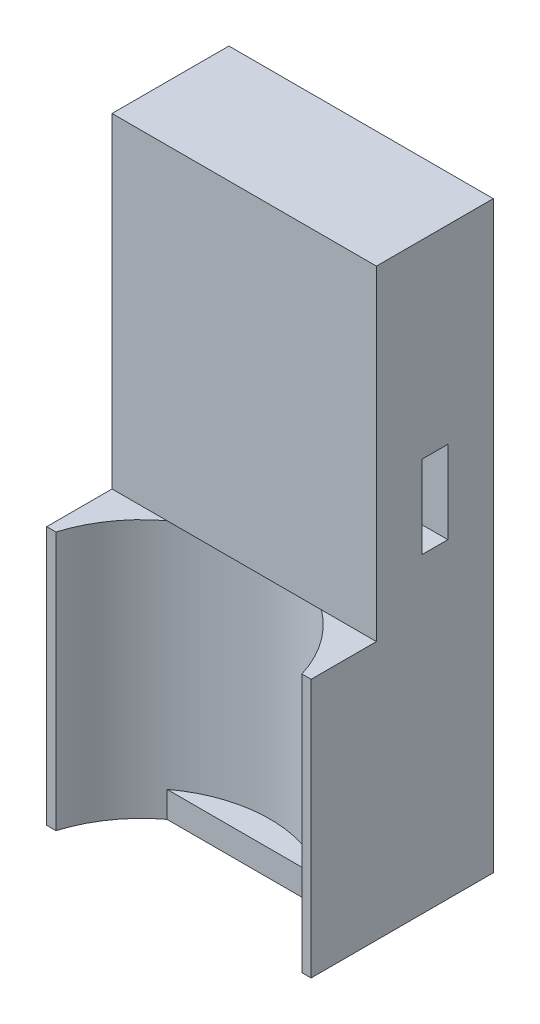
ISO-10303-21;
HEADER;
FILE_DESCRIPTION(('STEP AP214'),'2;1');
FILE_NAME('part.step','',(''),(''),'','','');
FILE_SCHEMA(('AUTOMOTIVE_DESIGN { 1 0 10303 214 1 1 1 1 }'));
ENDSEC;
DATA;
#1=APPLICATION_CONTEXT('core data for automotive mechanical design processes');
#2=APPLICATION_PROTOCOL_DEFINITION('international standard','automotive_design',2000,#1);
#3=PRODUCT_CONTEXT('',#1,'mechanical');
#4=PRODUCT('Part','Part','',(#3));
#5=PRODUCT_RELATED_PRODUCT_CATEGORY('part','',(#4));
#6=PRODUCT_DEFINITION_FORMATION('','',#4);
#7=PRODUCT_DEFINITION_CONTEXT('part definition',#1,'design');
#8=PRODUCT_DEFINITION('design','',#6,#7);
#9=PRODUCT_DEFINITION_SHAPE('','',#8);
#10=(LENGTH_UNIT() NAMED_UNIT(*) SI_UNIT(.MILLI.,.METRE.));
#11=(NAMED_UNIT(*) PLANE_ANGLE_UNIT() SI_UNIT($,.RADIAN.));
#12=(NAMED_UNIT(*) SI_UNIT($,.STERADIAN.) SOLID_ANGLE_UNIT());
#13=UNCERTAINTY_MEASURE_WITH_UNIT(LENGTH_MEASURE(1.E-05),#10,'distance_accuracy_value','');
#14=(GEOMETRIC_REPRESENTATION_CONTEXT(3) GLOBAL_UNCERTAINTY_ASSIGNED_CONTEXT((#13)) GLOBAL_UNIT_ASSIGNED_CONTEXT((#10,
#11,#12)) REPRESENTATION_CONTEXT('',''));
#15=CARTESIAN_POINT('',(0.,0.,0.));
#16=DIRECTION('',(0.,0.,1.));
#17=DIRECTION('',(1.,0.,0.));
#18=AXIS2_PLACEMENT_3D('',#15,#16,#17);
#19=CARTESIAN_POINT('',(-10.5990741194315,-54.83,-37.66));
#20=DIRECTION('',(0.,0.,1.));
#21=DIRECTION('',(1.,0.,0.));
#22=AXIS2_PLACEMENT_3D('',#19,#20,#21);
#23=PLANE('',#22);
#24=DIRECTION('',(0.,1.,0.));
#25=VECTOR('',#24,1.);
#26=CARTESIAN_POINT('',(-9.89,-54.83,-37.66));
#27=LINE('',#26,#25);
#28=CARTESIAN_POINT('',(-9.89,-58.8630773029,-37.66));
#29=VERTEX_POINT('',#28);
#30=CARTESIAN_POINT('',(-9.89,-38.9804,-37.66));
#31=VERTEX_POINT('',#30);
#32=EDGE_CURVE('E11',#29,#31,#27,.T.);
#33=ORIENTED_EDGE('',*,*,#32,.T.);
#34=DIRECTION('',(1.,0.,0.));
#35=VECTOR('',#34,1.);
#36=CARTESIAN_POINT('',(-30.21,-38.9804,-37.66));
#37=LINE('',#36,#35);
#38=CARTESIAN_POINT('',(-10.5990741194315,-38.9804,-37.66));
#39=VERTEX_POINT('',#38);
#40=EDGE_CURVE('E205',#39,#31,#37,.T.);
#41=ORIENTED_EDGE('',*,*,#40,.F.);
#42=DIRECTION('',(0.,-1.,0.));
#43=VECTOR('',#42,1.);
#44=CARTESIAN_POINT('',(-10.5990741194315,-54.83,-37.66));
#45=LINE('',#44,#43);
#46=CARTESIAN_POINT('',(-10.5990741194315,-58.8630773029,-37.66));
#47=VERTEX_POINT('',#46);
#48=EDGE_CURVE('E198',#39,#47,#45,.T.);
#49=ORIENTED_EDGE('',*,*,#48,.T.);
#50=DIRECTION('',(-1.,0.,0.));
#51=VECTOR('',#50,1.);
#52=CARTESIAN_POINT('',(-9.89,-58.8630773029,-37.66));
#53=LINE('',#52,#51);
#54=EDGE_CURVE('E250',#29,#47,#53,.T.);
#55=ORIENTED_EDGE('',*,*,#54,.F.);
#56=EDGE_LOOP('',(#33,#41,#49,#55));
#57=FACE_BOUND('',#56,.T.);
#58=ADVANCED_FACE('F17',(#57),#23,.T.);
#59=CARTESIAN_POINT('',(-9.89,-54.83,-37.66));
#60=DIRECTION('',(1.,0.,0.));
#61=DIRECTION('',(0.,0.,-1.));
#62=AXIS2_PLACEMENT_3D('',#59,#60,#61);
#63=PLANE('',#62);
#64=DIRECTION('',(0.,0.,-1.));
#65=VECTOR('',#64,1.);
#66=CARTESIAN_POINT('',(-9.89,-28.5918,-41.91475));
#67=LINE('',#66,#65);
#68=CARTESIAN_POINT('',(-9.89,-28.5918,-46.1695));
#69=VERTEX_POINT('',#68);
#70=CARTESIAN_POINT('',(-9.89,-28.5918,-48.1695));
#71=VERTEX_POINT('',#70);
#72=EDGE_CURVE('E230',#69,#71,#67,.T.);
#73=ORIENTED_EDGE('',*,*,#72,.T.);
#74=DIRECTION('',(0.,-1.,0.));
#75=VECTOR('',#74,1.);
#76=CARTESIAN_POINT('',(-9.89,-41.7109,-48.1695));
#77=LINE('',#76,#75);
#78=CARTESIAN_POINT('',(-9.89,-34.9418,-48.1695));
#79=VERTEX_POINT('',#78);
#80=EDGE_CURVE('E93',#71,#79,#77,.T.);
#81=ORIENTED_EDGE('',*,*,#80,.T.);
#82=DIRECTION('',(0.,0.,1.));
#83=VECTOR('',#82,1.);
#84=CARTESIAN_POINT('',(-9.89,-34.9418,-42.91475));
#85=LINE('',#84,#83);
#86=CARTESIAN_POINT('',(-9.89,-34.9418,-46.1695));
#87=VERTEX_POINT('',#86);
#88=EDGE_CURVE('E282',#79,#87,#85,.T.);
#89=ORIENTED_EDGE('',*,*,#88,.T.);
#90=DIRECTION('',(0.,1.,0.));
#91=VECTOR('',#90,1.);
#92=CARTESIAN_POINT('',(-9.89,-44.8859,-46.1695));
#93=LINE('',#92,#91);
#94=EDGE_CURVE('E267',#87,#69,#93,.T.);
#95=ORIENTED_EDGE('',*,*,#94,.T.);
#96=EDGE_LOOP('',(#73,#81,#89,#95));
#97=FACE_BOUND('',#96,.T.);
#98=DIRECTION('',(0.,-1.,0.));
#99=VECTOR('',#98,1.);
#100=CARTESIAN_POINT('',(-9.89,-54.83,-51.66));
#101=LINE('',#100,#99);
#102=CARTESIAN_POINT('',(-9.89,-13.9868,-51.66));
#103=VERTEX_POINT('',#102);
#104=CARTESIAN_POINT('',(-9.89,-58.8630773029,-51.66));
#105=VERTEX_POINT('',#104);
#106=EDGE_CURVE('E27',#103,#105,#101,.T.);
#107=ORIENTED_EDGE('',*,*,#106,.F.);
#108=DIRECTION('',(0.,0.,-1.));
#109=VECTOR('',#108,1.);
#110=CARTESIAN_POINT('',(-9.89,-13.9868,-37.66));
#111=LINE('',#110,#109);
#112=CARTESIAN_POINT('',(-9.89,-13.9868,-42.679));
#113=VERTEX_POINT('',#112);
#114=EDGE_CURVE('E259',#113,#103,#111,.T.);
#115=ORIENTED_EDGE('',*,*,#114,.F.);
#116=DIRECTION('',(0.,1.,0.));
#117=VECTOR('',#116,1.);
#118=CARTESIAN_POINT('',(-9.89,-38.9804,-42.679));
#119=LINE('',#118,#117);
#120=CARTESIAN_POINT('',(-9.89,-38.9804,-42.679));
#121=VERTEX_POINT('',#120);
#122=EDGE_CURVE('E383',#121,#113,#119,.T.);
#123=ORIENTED_EDGE('',*,*,#122,.F.);
#124=DIRECTION('',(0.,0.,-1.));
#125=VECTOR('',#124,1.);
#126=CARTESIAN_POINT('',(-9.89,-38.9804,-37.66));
#127=LINE('',#126,#125);
#128=EDGE_CURVE('E202',#31,#121,#127,.T.);
#129=ORIENTED_EDGE('',*,*,#128,.F.);
#130=ORIENTED_EDGE('',*,*,#32,.F.);
#131=DIRECTION('',(0.,0.,1.));
#132=VECTOR('',#131,1.);
#133=CARTESIAN_POINT('',(-9.89,-58.8630773029,-51.66));
#134=LINE('',#133,#132);
#135=EDGE_CURVE('E273',#105,#29,#134,.T.);
#136=ORIENTED_EDGE('',*,*,#135,.F.);
#137=EDGE_LOOP('',(#107,#115,#123,#129,#130,#136));
#138=FACE_BOUND('',#137,.T.);
#139=ADVANCED_FACE('F368',(#97,#138),#63,.T.);
#140=CARTESIAN_POINT('',(-9.89,-54.83,-51.66));
#141=DIRECTION('',(0.,0.,-1.));
#142=DIRECTION('',(-1.,0.,0.));
#143=AXIS2_PLACEMENT_3D('',#140,#141,#142);
#144=PLANE('',#143);
#145=CARTESIAN_POINT('',(-20.05,-23.8630773029,-51.66));
#146=DIRECTION('',(0.,0.,1.));
#147=DIRECTION('',(1.,0.,0.));
#148=AXIS2_PLACEMENT_3D('',#145,#146,#147);
#149=CIRCLE('',#148,1.5);
#150=CARTESIAN_POINT('',(-21.55,-23.8630773029,-51.66));
#151=VERTEX_POINT('',#150);
#152=EDGE_CURVE('E192',#151,#151,#149,.T.);
#153=ORIENTED_EDGE('',*,*,#152,.T.);
#154=EDGE_LOOP('',(#153));
#155=FACE_BOUND('',#154,.T.);
#156=CARTESIAN_POINT('',(-20.05,-36.5630773029001,-51.66));
#157=DIRECTION('',(0.,0.,1.));
#158=DIRECTION('',(1.,0.,0.));
#159=AXIS2_PLACEMENT_3D('',#156,#157,#158);
#160=CIRCLE('',#159,1.5);
#161=CARTESIAN_POINT('',(-21.55,-36.5630773029001,-51.66));
#162=VERTEX_POINT('',#161);
#163=EDGE_CURVE('E290',#162,#162,#160,.T.);
#164=ORIENTED_EDGE('',*,*,#163,.T.);
#165=EDGE_LOOP('',(#164));
#166=FACE_BOUND('',#165,.T.);
#167=CARTESIAN_POINT('',(-20.05,-49.2630773029001,-51.66));
#168=DIRECTION('',(0.,0.,1.));
#169=DIRECTION('',(1.,0.,0.));
#170=AXIS2_PLACEMENT_3D('',#167,#168,#169);
#171=CIRCLE('',#170,1.5);
#172=CARTESIAN_POINT('',(-21.55,-49.2630773029001,-51.66));
#173=VERTEX_POINT('',#172);
#174=EDGE_CURVE('E211',#173,#173,#171,.T.);
#175=ORIENTED_EDGE('',*,*,#174,.T.);
#176=EDGE_LOOP('',(#175));
#177=FACE_BOUND('',#176,.T.);
#178=DIRECTION('',(0.,-1.,0.));
#179=VECTOR('',#178,1.);
#180=CARTESIAN_POINT('',(-30.21,-54.83,-51.66));
#181=LINE('',#180,#179);
#182=CARTESIAN_POINT('',(-30.21,-13.9868,-51.66));
#183=VERTEX_POINT('',#182);
#184=CARTESIAN_POINT('',(-30.21,-58.8630773029,-51.66));
#185=VERTEX_POINT('',#184);
#186=EDGE_CURVE('E237',#183,#185,#181,.T.);
#187=ORIENTED_EDGE('',*,*,#186,.F.);
#188=DIRECTION('',(-1.,0.,0.));
#189=VECTOR('',#188,1.);
#190=CARTESIAN_POINT('',(-9.89,-13.9868,-51.66));
#191=LINE('',#190,#189);
#192=EDGE_CURVE('E263',#103,#183,#191,.T.);
#193=ORIENTED_EDGE('',*,*,#192,.F.);
#194=ORIENTED_EDGE('',*,*,#106,.T.);
#195=DIRECTION('',(1.,0.,0.));
#196=VECTOR('',#195,1.);
#197=CARTESIAN_POINT('',(-30.21,-58.8630773029,-51.66));
#198=LINE('',#197,#196);
#199=EDGE_CURVE('E269',#185,#105,#198,.T.);
#200=ORIENTED_EDGE('',*,*,#199,.F.);
#201=EDGE_LOOP('',(#187,#193,#194,#200));
#202=FACE_BOUND('',#201,.T.);
#203=ADVANCED_FACE('F431',(#155,#166,#177,#202),#144,.T.);
#204=CARTESIAN_POINT('',(-30.21,-54.83,-51.66));
#205=DIRECTION('',(-1.,0.,0.));
#206=DIRECTION('',(0.,0.,1.));
#207=AXIS2_PLACEMENT_3D('',#204,#205,#206);
#208=PLANE('',#207);
#209=DIRECTION('',(0.,0.,1.));
#210=VECTOR('',#209,1.);
#211=CARTESIAN_POINT('',(-30.21,-28.5918,-48.91475));
#212=LINE('',#211,#210);
#213=CARTESIAN_POINT('',(-30.21,-28.5918,-48.1695));
#214=VERTEX_POINT('',#213);
#215=CARTESIAN_POINT('',(-30.21,-28.5918,-46.1695));
#216=VERTEX_POINT('',#215);
#217=EDGE_CURVE('E182',#214,#216,#212,.T.);
#218=ORIENTED_EDGE('',*,*,#217,.T.);
#219=DIRECTION('',(0.,-1.,0.));
#220=VECTOR('',#219,1.);
#221=CARTESIAN_POINT('',(-30.21,-44.8859,-46.1695));
#222=LINE('',#221,#220);
#223=CARTESIAN_POINT('',(-30.21,-34.9418,-46.1695));
#224=VERTEX_POINT('',#223);
#225=EDGE_CURVE('E134',#216,#224,#222,.T.);
#226=ORIENTED_EDGE('',*,*,#225,.T.);
#227=DIRECTION('',(0.,0.,-1.));
#228=VECTOR('',#227,1.);
#229=CARTESIAN_POINT('',(-30.21,-34.9418,-49.91475));
#230=LINE('',#229,#228);
#231=CARTESIAN_POINT('',(-30.21,-34.9418,-48.1695));
#232=VERTEX_POINT('',#231);
#233=EDGE_CURVE('E285',#224,#232,#230,.T.);
#234=ORIENTED_EDGE('',*,*,#233,.T.);
#235=DIRECTION('',(0.,1.,0.));
#236=VECTOR('',#235,1.);
#237=CARTESIAN_POINT('',(-30.21,-41.7109,-48.1695));
#238=LINE('',#237,#236);
#239=EDGE_CURVE('E251',#232,#214,#238,.T.);
#240=ORIENTED_EDGE('',*,*,#239,.T.);
#241=EDGE_LOOP('',(#218,#226,#234,#240));
#242=FACE_BOUND('',#241,.T.);
#243=DIRECTION('',(0.,-1.,0.));
#244=VECTOR('',#243,1.);
#245=CARTESIAN_POINT('',(-30.21,-54.83,-37.66));
#246=LINE('',#245,#244);
#247=CARTESIAN_POINT('',(-30.21,-38.9804,-37.66));
#248=VERTEX_POINT('',#247);
#249=CARTESIAN_POINT('',(-30.21,-58.8630773029,-37.66));
#250=VERTEX_POINT('',#249);
#251=EDGE_CURVE('E241',#248,#250,#246,.T.);
#252=ORIENTED_EDGE('',*,*,#251,.F.);
#253=DIRECTION('',(0.,0.,1.));
#254=VECTOR('',#253,1.);
#255=CARTESIAN_POINT('',(-30.21,-38.9804,-51.66));
#256=LINE('',#255,#254);
#257=CARTESIAN_POINT('',(-30.21,-38.9804,-42.679));
#258=VERTEX_POINT('',#257);
#259=EDGE_CURVE('E221',#258,#248,#256,.T.);
#260=ORIENTED_EDGE('',*,*,#259,.F.);
#261=DIRECTION('',(0.,1.,0.));
#262=VECTOR('',#261,1.);
#263=CARTESIAN_POINT('',(-30.21,-38.9804,-42.679));
#264=LINE('',#263,#262);
#265=CARTESIAN_POINT('',(-30.21,-13.9868,-42.679));
#266=VERTEX_POINT('',#265);
#267=EDGE_CURVE('E264',#258,#266,#264,.T.);
#268=ORIENTED_EDGE('',*,*,#267,.T.);
#269=DIRECTION('',(0.,0.,1.));
#270=VECTOR('',#269,1.);
#271=CARTESIAN_POINT('',(-30.21,-13.9868,-51.66));
#272=LINE('',#271,#270);
#273=EDGE_CURVE('E20',#183,#266,#272,.T.);
#274=ORIENTED_EDGE('',*,*,#273,.F.);
#275=ORIENTED_EDGE('',*,*,#186,.T.);
#276=DIRECTION('',(0.,0.,-1.));
#277=VECTOR('',#276,1.);
#278=CARTESIAN_POINT('',(-30.21,-58.8630773029,-37.66));
#279=LINE('',#278,#277);
#280=EDGE_CURVE('E274',#250,#185,#279,.T.);
#281=ORIENTED_EDGE('',*,*,#280,.F.);
#282=EDGE_LOOP('',(#252,#260,#268,#274,#275,#281));
#283=FACE_BOUND('',#282,.T.);
#284=ADVANCED_FACE('F347',(#242,#283),#208,.T.);
#285=CARTESIAN_POINT('',(-30.21,-54.83,-37.66));
#286=DIRECTION('',(0.,0.,1.));
#287=DIRECTION('',(1.,0.,0.));
#288=AXIS2_PLACEMENT_3D('',#285,#286,#287);
#289=PLANE('',#288);
#290=DIRECTION('',(0.,-1.,0.));
#291=VECTOR('',#290,1.);
#292=CARTESIAN_POINT('',(-29.5009258805685,-54.83,-37.66));
#293=LINE('',#292,#291);
#294=CARTESIAN_POINT('',(-29.5009258805685,-38.9804,-37.66));
#295=VERTEX_POINT('',#294);
#296=CARTESIAN_POINT('',(-29.5009258805685,-58.8630773029,-37.66));
#297=VERTEX_POINT('',#296);
#298=EDGE_CURVE('E201',#295,#297,#293,.T.);
#299=ORIENTED_EDGE('',*,*,#298,.F.);
#300=DIRECTION('',(1.,0.,0.));
#301=VECTOR('',#300,1.);
#302=CARTESIAN_POINT('',(-30.21,-38.9804,-37.66));
#303=LINE('',#302,#301);
#304=EDGE_CURVE('E222',#248,#295,#303,.T.);
#305=ORIENTED_EDGE('',*,*,#304,.F.);
#306=ORIENTED_EDGE('',*,*,#251,.T.);
#307=DIRECTION('',(-1.,0.,0.));
#308=VECTOR('',#307,1.);
#309=CARTESIAN_POINT('',(-29.5009258805685,-58.8630773029,-37.66));
#310=LINE('',#309,#308);
#311=EDGE_CURVE('E235',#297,#250,#310,.T.);
#312=ORIENTED_EDGE('',*,*,#311,.F.);
#313=EDGE_LOOP('',(#299,#305,#306,#312));
#314=FACE_BOUND('',#313,.T.);
#315=ADVANCED_FACE('F344',(#314),#289,.T.);
#316=CARTESIAN_POINT('',(-20.05,-54.83,-34.78));
#317=DIRECTION('',(0.,1.,0.));
#318=DIRECTION('',(-1.,0.,0.));
#319=AXIS2_PLACEMENT_3D('',#316,#317,#318);
#320=CYLINDRICAL_SURFACE('',#319,9.88);
#321=ORIENTED_EDGE('',*,*,#48,.F.);
#322=CARTESIAN_POINT('',(-20.05,-38.9804,-34.78));
#323=DIRECTION('',(0.,-1.,0.));
#324=DIRECTION('',(-1.,0.,0.));
#325=AXIS2_PLACEMENT_3D('',#322,#323,#324);
#326=CIRCLE('',#325,9.88);
#327=CARTESIAN_POINT('',(-14.1153391840813,-38.9804,-42.679));
#328=VERTEX_POINT('',#327);
#329=EDGE_CURVE('E227',#328,#39,#326,.T.);
#330=ORIENTED_EDGE('',*,*,#329,.F.);
#331=CARTESIAN_POINT('',(-20.05,-38.9804,-34.78));
#332=DIRECTION('',(0.,-1.,0.));
#333=DIRECTION('',(-1.,0.,0.));
#334=AXIS2_PLACEMENT_3D('',#331,#332,#333);
#335=CIRCLE('',#334,9.88);
#336=CARTESIAN_POINT('',(-25.9846608159186,-38.9804,-42.679));
#337=VERTEX_POINT('',#336);
#338=EDGE_CURVE('E217',#337,#328,#335,.T.);
#339=ORIENTED_EDGE('',*,*,#338,.F.);
#340=CARTESIAN_POINT('',(-20.05,-38.9804,-34.78));
#341=DIRECTION('',(0.,-1.,0.));
#342=DIRECTION('',(-1.,0.,0.));
#343=AXIS2_PLACEMENT_3D('',#340,#341,#342);
#344=CIRCLE('',#343,9.88);
#345=EDGE_CURVE('E78',#295,#337,#344,.T.);
#346=ORIENTED_EDGE('',*,*,#345,.F.);
#347=ORIENTED_EDGE('',*,*,#298,.T.);
#348=CARTESIAN_POINT('',(-20.05,-58.8630773029,-34.78));
#349=DIRECTION('',(0.,1.,0.));
#350=DIRECTION('',(-0.956571445401673,0.,-0.291497975708502));
#351=AXIS2_PLACEMENT_3D('',#348,#349,#350);
#352=CIRCLE('',#351,9.88);
#353=CARTESIAN_POINT('',(-25.9846608159186,-58.8630773029,-42.679));
#354=VERTEX_POINT('',#353);
#355=EDGE_CURVE('E216',#354,#297,#352,.T.);
#356=ORIENTED_EDGE('',*,*,#355,.F.);
#357=DIRECTION('',(0.,-1.,0.));
#358=VECTOR('',#357,1.);
#359=CARTESIAN_POINT('',(-25.9846608159186,-56.8630773029001,-42.679));
#360=LINE('',#359,#358);
#361=CARTESIAN_POINT('',(-25.9846608159186,-56.8630773029001,-42.679));
#362=VERTEX_POINT('',#361);
#363=EDGE_CURVE('E278',#362,#354,#360,.T.);
#364=ORIENTED_EDGE('',*,*,#363,.F.);
#365=CARTESIAN_POINT('',(-20.05,-56.8630773029001,-34.78));
#366=DIRECTION('',(0.,1.,0.));
#367=DIRECTION('',(-1.,0.,0.));
#368=AXIS2_PLACEMENT_3D('',#365,#366,#367);
#369=CIRCLE('',#368,9.88);
#370=CARTESIAN_POINT('',(-14.1153391840813,-56.8630773029001,-42.679));
#371=VERTEX_POINT('',#370);
#372=EDGE_CURVE('E212',#371,#362,#369,.T.);
#373=ORIENTED_EDGE('',*,*,#372,.F.);
#374=DIRECTION('',(0.,-1.,0.));
#375=VECTOR('',#374,1.);
#376=CARTESIAN_POINT('',(-14.1153391840813,-56.8630773029001,-42.679));
#377=LINE('',#376,#375);
#378=CARTESIAN_POINT('',(-14.1153391840813,-58.8630773029,-42.679));
#379=VERTEX_POINT('',#378);
#380=EDGE_CURVE('E231',#371,#379,#377,.T.);
#381=ORIENTED_EDGE('',*,*,#380,.T.);
#382=CARTESIAN_POINT('',(-20.05,-58.8630773029,-34.78));
#383=DIRECTION('',(0.,1.,0.));
#384=DIRECTION('',(-0.956571445401673,0.,-0.291497975708502));
#385=AXIS2_PLACEMENT_3D('',#382,#383,#384);
#386=CIRCLE('',#385,9.88);
#387=EDGE_CURVE('E247',#47,#379,#386,.T.);
#388=ORIENTED_EDGE('',*,*,#387,.F.);
#389=EDGE_LOOP('',(#321,#330,#339,#346,#347,#356,#364,#373,#381,#388));
#390=FACE_BOUND('',#389,.T.);
#391=ADVANCED_FACE('F335',(#390),#320,.F.);
#392=CARTESIAN_POINT('',(-20.05,-38.9804,-44.66));
#393=DIRECTION('',(0.,-1.,0.));
#394=DIRECTION('',(0.,0.,-1.));
#395=AXIS2_PLACEMENT_3D('',#392,#393,#394);
#396=PLANE('',#395);
#397=DIRECTION('',(-1.,0.,0.));
#398=VECTOR('',#397,1.);
#399=CARTESIAN_POINT('',(-25.13,-38.9804,-42.679));
#400=LINE('',#399,#398);
#401=EDGE_CURVE('E304',#121,#328,#400,.T.);
#402=ORIENTED_EDGE('',*,*,#401,.T.);
#403=ORIENTED_EDGE('',*,*,#329,.T.);
#404=ORIENTED_EDGE('',*,*,#40,.T.);
#405=ORIENTED_EDGE('',*,*,#128,.T.);
#406=EDGE_LOOP('',(#402,#403,#404,#405));
#407=FACE_BOUND('',#406,.T.);
#408=ADVANCED_FACE('F781',(#407),#396,.F.);
#409=CARTESIAN_POINT('',(-20.05,-38.9804,-44.66));
#410=DIRECTION('',(0.,-1.,0.));
#411=DIRECTION('',(0.,0.,-1.));
#412=AXIS2_PLACEMENT_3D('',#409,#410,#411);
#413=PLANE('',#412);
#414=DIRECTION('',(-1.,0.,0.));
#415=VECTOR('',#414,1.);
#416=CARTESIAN_POINT('',(-25.13,-38.9804,-42.679));
#417=LINE('',#416,#415);
#418=EDGE_CURVE('E255',#337,#258,#417,.T.);
#419=ORIENTED_EDGE('',*,*,#418,.T.);
#420=ORIENTED_EDGE('',*,*,#259,.T.);
#421=ORIENTED_EDGE('',*,*,#304,.T.);
#422=ORIENTED_EDGE('',*,*,#345,.T.);
#423=EDGE_LOOP('',(#419,#420,#421,#422));
#424=FACE_BOUND('',#423,.T.);
#425=ADVANCED_FACE('F450',(#424),#413,.F.);
#426=CARTESIAN_POINT('',(-20.05,-38.9804,-47.1695));
#427=DIRECTION('',(0.,1.,0.));
#428=DIRECTION('',(0.,0.,-1.));
#429=AXIS2_PLACEMENT_3D('',#426,#427,#428);
#430=PLANE('',#429);
#431=ORIENTED_EDGE('',*,*,#338,.T.);
#432=DIRECTION('',(1.,0.,0.));
#433=VECTOR('',#432,1.);
#434=CARTESIAN_POINT('',(-30.21,-38.9804,-42.679));
#435=LINE('',#434,#433);
#436=EDGE_CURVE('E258',#337,#328,#435,.T.);
#437=ORIENTED_EDGE('',*,*,#436,.F.);
#438=EDGE_LOOP('',(#431,#437));
#439=FACE_BOUND('',#438,.T.);
#440=ADVANCED_FACE('F446',(#439),#430,.F.);
#441=CARTESIAN_POINT('',(-20.05,-13.9868,-47.1695));
#442=DIRECTION('',(0.,1.,0.));
#443=DIRECTION('',(0.,0.,-1.));
#444=AXIS2_PLACEMENT_3D('',#441,#442,#443);
#445=PLANE('',#444);
#446=DIRECTION('',(1.,0.,0.));
#447=VECTOR('',#446,1.);
#448=CARTESIAN_POINT('',(-30.21,-13.9868,-42.679));
#449=LINE('',#448,#447);
#450=EDGE_CURVE('E314',#266,#113,#449,.T.);
#451=ORIENTED_EDGE('',*,*,#450,.T.);
#452=ORIENTED_EDGE('',*,*,#114,.T.);
#453=ORIENTED_EDGE('',*,*,#192,.T.);
#454=ORIENTED_EDGE('',*,*,#273,.T.);
#455=EDGE_LOOP('',(#451,#452,#453,#454));
#456=FACE_BOUND('',#455,.T.);
#457=ADVANCED_FACE('F422',(#456),#445,.T.);
#458=CARTESIAN_POINT('',(-30.21,-38.9804,-42.679));
#459=DIRECTION('',(0.,0.,1.));
#460=DIRECTION('',(1.,0.,0.));
#461=AXIS2_PLACEMENT_3D('',#458,#459,#460);
#462=PLANE('',#461);
#463=ORIENTED_EDGE('',*,*,#418,.F.);
#464=ORIENTED_EDGE('',*,*,#436,.T.);
#465=ORIENTED_EDGE('',*,*,#401,.F.);
#466=ORIENTED_EDGE('',*,*,#122,.T.);
#467=ORIENTED_EDGE('',*,*,#450,.F.);
#468=ORIENTED_EDGE('',*,*,#267,.F.);
#469=EDGE_LOOP('',(#463,#464,#465,#466,#467,#468));
#470=FACE_BOUND('',#469,.T.);
#471=ADVANCED_FACE('F414',(#470),#462,.T.);
#472=CARTESIAN_POINT('',(-9.89,-28.5918,-48.1695));
#473=DIRECTION('',(0.,0.,-1.));
#474=DIRECTION('',(0.,-1.,0.));
#475=AXIS2_PLACEMENT_3D('',#472,#473,#474);
#476=PLANE('',#475);
#477=ORIENTED_EDGE('',*,*,#239,.F.);
#478=DIRECTION('',(-1.,0.,0.));
#479=VECTOR('',#478,1.);
#480=CARTESIAN_POINT('',(-9.89,-34.9418,-48.1695));
#481=LINE('',#480,#479);
#482=EDGE_CURVE('E253',#79,#232,#481,.T.);
#483=ORIENTED_EDGE('',*,*,#482,.F.);
#484=ORIENTED_EDGE('',*,*,#80,.F.);
#485=DIRECTION('',(-1.,0.,0.));
#486=VECTOR('',#485,1.);
#487=CARTESIAN_POINT('',(-9.89,-28.5918,-48.1695));
#488=LINE('',#487,#486);
#489=EDGE_CURVE('E190',#71,#214,#488,.T.);
#490=ORIENTED_EDGE('',*,*,#489,.T.);
#491=EDGE_LOOP('',(#477,#483,#484,#490));
#492=FACE_BOUND('',#491,.T.);
#493=ADVANCED_FACE('F412',(#492),#476,.F.);
#494=CARTESIAN_POINT('',(-9.89,-34.9418,-48.1695));
#495=DIRECTION('',(0.,-1.,0.));
#496=DIRECTION('',(-1.,0.,0.));
#497=AXIS2_PLACEMENT_3D('',#494,#495,#496);
#498=PLANE('',#497);
#499=ORIENTED_EDGE('',*,*,#233,.F.);
#500=DIRECTION('',(-1.,0.,0.));
#501=VECTOR('',#500,1.);
#502=CARTESIAN_POINT('',(-9.89,-34.9418,-46.1695));
#503=LINE('',#502,#501);
#504=EDGE_CURVE('E371',#87,#224,#503,.T.);
#505=ORIENTED_EDGE('',*,*,#504,.F.);
#506=ORIENTED_EDGE('',*,*,#88,.F.);
#507=ORIENTED_EDGE('',*,*,#482,.T.);
#508=EDGE_LOOP('',(#499,#505,#506,#507));
#509=FACE_BOUND('',#508,.T.);
#510=ADVANCED_FACE('F372',(#509),#498,.F.);
#511=CARTESIAN_POINT('',(-9.89,-34.9418,-46.1695));
#512=DIRECTION('',(0.,0.,1.));
#513=DIRECTION('',(1.,0.,0.));
#514=AXIS2_PLACEMENT_3D('',#511,#512,#513);
#515=PLANE('',#514);
#516=ORIENTED_EDGE('',*,*,#225,.F.);
#517=DIRECTION('',(-1.,0.,0.));
#518=VECTOR('',#517,1.);
#519=CARTESIAN_POINT('',(-9.89,-28.5918,-46.1695));
#520=LINE('',#519,#518);
#521=EDGE_CURVE('E268',#69,#216,#520,.T.);
#522=ORIENTED_EDGE('',*,*,#521,.F.);
#523=ORIENTED_EDGE('',*,*,#94,.F.);
#524=ORIENTED_EDGE('',*,*,#504,.T.);
#525=EDGE_LOOP('',(#516,#522,#523,#524));
#526=FACE_BOUND('',#525,.T.);
#527=ADVANCED_FACE('F375',(#526),#515,.F.);
#528=CARTESIAN_POINT('',(-9.89,-28.5918,-46.1695));
#529=DIRECTION('',(0.,1.,0.));
#530=DIRECTION('',(0.,0.,-1.));
#531=AXIS2_PLACEMENT_3D('',#528,#529,#530);
#532=PLANE('',#531);
#533=ORIENTED_EDGE('',*,*,#217,.F.);
#534=ORIENTED_EDGE('',*,*,#489,.F.);
#535=ORIENTED_EDGE('',*,*,#72,.F.);
#536=ORIENTED_EDGE('',*,*,#521,.T.);
#537=EDGE_LOOP('',(#533,#534,#535,#536));
#538=FACE_BOUND('',#537,.T.);
#539=ADVANCED_FACE('F411',(#538),#532,.F.);
#540=CARTESIAN_POINT('',(-20.05,-23.8630773029,-46.16));
#541=DIRECTION('',(0.,0.,-1.));
#542=DIRECTION('',(-1.,0.,0.));
#543=AXIS2_PLACEMENT_3D('',#540,#541,#542);
#544=PLANE('',#543);
#545=CARTESIAN_POINT('',(-20.05,-23.8630773029,-46.16));
#546=DIRECTION('',(0.,0.,1.));
#547=DIRECTION('',(1.,0.,0.));
#548=AXIS2_PLACEMENT_3D('',#545,#546,#547);
#549=CIRCLE('',#548,1.5);
#550=CARTESIAN_POINT('',(-21.55,-23.8630773029,-46.16));
#551=VERTEX_POINT('',#550);
#552=EDGE_CURVE('E175',#551,#551,#549,.T.);
#553=ORIENTED_EDGE('',*,*,#552,.F.);
#554=EDGE_LOOP('',(#553));
#555=FACE_BOUND('',#554,.T.);
#556=ADVANCED_FACE('F441',(#555),#544,.T.);
#557=CARTESIAN_POINT('',(-20.05,-23.8630773029,-51.66));
#558=DIRECTION('',(0.,0.,1.));
#559=DIRECTION('',(1.,0.,0.));
#560=AXIS2_PLACEMENT_3D('',#557,#558,#559);
#561=CYLINDRICAL_SURFACE('',#560,1.5);
#562=ORIENTED_EDGE('',*,*,#152,.F.);
#563=DIRECTION('',(0.,0.,1.));
#564=VECTOR('',#563,1.);
#565=CARTESIAN_POINT('',(-21.55,-23.8630773029,-51.66));
#566=LINE('',#565,#564);
#567=EDGE_CURVE('E178',#151,#551,#566,.T.);
#568=ORIENTED_EDGE('',*,*,#567,.T.);
#569=ORIENTED_EDGE('',*,*,#552,.T.);
#570=ORIENTED_EDGE('',*,*,#567,.F.);
#571=EDGE_LOOP('',(#562,#568,#569,#570));
#572=FACE_BOUND('',#571,.T.);
#573=ADVANCED_FACE('F177',(#572),#561,.F.);
#574=CARTESIAN_POINT('',(-20.05,-36.5630773029001,-46.16));
#575=DIRECTION('',(0.,0.,-1.));
#576=DIRECTION('',(-1.,0.,0.));
#577=AXIS2_PLACEMENT_3D('',#574,#575,#576);
#578=PLANE('',#577);
#579=CARTESIAN_POINT('',(-20.05,-36.5630773029001,-46.16));
#580=DIRECTION('',(0.,0.,1.));
#581=DIRECTION('',(1.,0.,0.));
#582=AXIS2_PLACEMENT_3D('',#579,#580,#581);
#583=CIRCLE('',#582,1.5);
#584=CARTESIAN_POINT('',(-21.55,-36.5630773029001,-46.16));
#585=VERTEX_POINT('',#584);
#586=EDGE_CURVE('E244',#585,#585,#583,.T.);
#587=ORIENTED_EDGE('',*,*,#586,.F.);
#588=EDGE_LOOP('',(#587));
#589=FACE_BOUND('',#588,.T.);
#590=ADVANCED_FACE('F455',(#589),#578,.T.);
#591=CARTESIAN_POINT('',(-20.05,-36.5630773029001,-51.66));
#592=DIRECTION('',(0.,0.,1.));
#593=DIRECTION('',(1.,0.,0.));
#594=AXIS2_PLACEMENT_3D('',#591,#592,#593);
#595=CYLINDRICAL_SURFACE('',#594,1.5);
#596=ORIENTED_EDGE('',*,*,#163,.F.);
#597=DIRECTION('',(0.,0.,1.));
#598=VECTOR('',#597,1.);
#599=CARTESIAN_POINT('',(-21.55,-36.5630773029001,-51.66));
#600=LINE('',#599,#598);
#601=EDGE_CURVE('E286',#162,#585,#600,.T.);
#602=ORIENTED_EDGE('',*,*,#601,.T.);
#603=ORIENTED_EDGE('',*,*,#586,.T.);
#604=ORIENTED_EDGE('',*,*,#601,.F.);
#605=EDGE_LOOP('',(#596,#602,#603,#604));
#606=FACE_BOUND('',#605,.T.);
#607=ADVANCED_FACE('F452',(#606),#595,.F.);
#608=CARTESIAN_POINT('',(-20.05,-49.2630773029001,-46.16));
#609=DIRECTION('',(0.,0.,-1.));
#610=DIRECTION('',(-1.,0.,0.));
#611=AXIS2_PLACEMENT_3D('',#608,#609,#610);
#612=PLANE('',#611);
#613=CARTESIAN_POINT('',(-20.05,-49.2630773029001,-46.16));
#614=DIRECTION('',(0.,0.,1.));
#615=DIRECTION('',(1.,0.,0.));
#616=AXIS2_PLACEMENT_3D('',#613,#614,#615);
#617=CIRCLE('',#616,1.5);
#618=CARTESIAN_POINT('',(-21.55,-49.2630773029001,-46.16));
#619=VERTEX_POINT('',#618);
#620=EDGE_CURVE('E210',#619,#619,#617,.T.);
#621=ORIENTED_EDGE('',*,*,#620,.F.);
#622=EDGE_LOOP('',(#621));
#623=FACE_BOUND('',#622,.T.);
#624=ADVANCED_FACE('F454',(#623),#612,.T.);
#625=CARTESIAN_POINT('',(-20.05,-49.2630773029001,-51.66));
#626=DIRECTION('',(0.,0.,1.));
#627=DIRECTION('',(1.,0.,0.));
#628=AXIS2_PLACEMENT_3D('',#625,#626,#627);
#629=CYLINDRICAL_SURFACE('',#628,1.5);
#630=ORIENTED_EDGE('',*,*,#174,.F.);
#631=DIRECTION('',(0.,0.,1.));
#632=VECTOR('',#631,1.);
#633=CARTESIAN_POINT('',(-21.55,-49.2630773029001,-51.66));
#634=LINE('',#633,#632);
#635=EDGE_CURVE('E206',#173,#619,#634,.T.);
#636=ORIENTED_EDGE('',*,*,#635,.T.);
#637=ORIENTED_EDGE('',*,*,#620,.T.);
#638=ORIENTED_EDGE('',*,*,#635,.F.);
#639=EDGE_LOOP('',(#630,#636,#637,#638));
#640=FACE_BOUND('',#639,.T.);
#641=ADVANCED_FACE('F461',(#640),#629,.F.);
#642=CARTESIAN_POINT('',(-20.05,-56.8630773029001,-44.66));
#643=DIRECTION('',(0.,-1.,0.));
#644=DIRECTION('',(0.,0.,-1.));
#645=AXIS2_PLACEMENT_3D('',#642,#643,#644);
#646=PLANE('',#645);
#647=ORIENTED_EDGE('',*,*,#372,.T.);
#648=DIRECTION('',(-1.,0.,0.));
#649=VECTOR('',#648,1.);
#650=CARTESIAN_POINT('',(-14.1153391840813,-56.8630773029001,-42.679));
#651=LINE('',#650,#649);
#652=EDGE_CURVE('E196',#371,#362,#651,.T.);
#653=ORIENTED_EDGE('',*,*,#652,.F.);
#654=EDGE_LOOP('',(#647,#653));
#655=FACE_BOUND('',#654,.T.);
#656=ADVANCED_FACE('F503',(#655),#646,.F.);
#657=CARTESIAN_POINT('',(-20.05,-58.8630773029,-44.66));
#658=DIRECTION('',(0.,-1.,0.));
#659=DIRECTION('',(0.,0.,-1.));
#660=AXIS2_PLACEMENT_3D('',#657,#658,#659);
#661=PLANE('',#660);
#662=ORIENTED_EDGE('',*,*,#311,.T.);
#663=ORIENTED_EDGE('',*,*,#280,.T.);
#664=ORIENTED_EDGE('',*,*,#199,.T.);
#665=ORIENTED_EDGE('',*,*,#135,.T.);
#666=ORIENTED_EDGE('',*,*,#54,.T.);
#667=ORIENTED_EDGE('',*,*,#387,.T.);
#668=DIRECTION('',(-1.,0.,0.));
#669=VECTOR('',#668,1.);
#670=CARTESIAN_POINT('',(-14.1153391840813,-58.8630773029,-42.679));
#671=LINE('',#670,#669);
#672=EDGE_CURVE('E236',#379,#354,#671,.T.);
#673=ORIENTED_EDGE('',*,*,#672,.T.);
#674=ORIENTED_EDGE('',*,*,#355,.T.);
#675=EDGE_LOOP('',(#662,#663,#664,#665,#666,#667,#673,#674));
#676=FACE_BOUND('',#675,.T.);
#677=ADVANCED_FACE('F341',(#676),#661,.T.);
#678=CARTESIAN_POINT('',(-14.1153391840813,-56.8630773029001,-42.679));
#679=DIRECTION('',(0.,0.,1.));
#680=DIRECTION('',(1.,0.,0.));
#681=AXIS2_PLACEMENT_3D('',#678,#679,#680);
#682=PLANE('',#681);
#683=ORIENTED_EDGE('',*,*,#652,.T.);
#684=ORIENTED_EDGE('',*,*,#363,.T.);
#685=ORIENTED_EDGE('',*,*,#672,.F.);
#686=ORIENTED_EDGE('',*,*,#380,.F.);
#687=EDGE_LOOP('',(#683,#684,#685,#686));
#688=FACE_BOUND('',#687,.T.);
#689=ADVANCED_FACE('F439',(#688),#682,.T.);
#690=CLOSED_SHELL('',(#58,#139,#203,#284,#315,#391,#408,#425,#440,#457,#471,#493,#510,#527,#539,
#556,#573,#590,#607,#624,#641,#656,#677,#689));
#691=MANIFOLD_SOLID_BREP('B1',#690);
#692=ADVANCED_BREP_SHAPE_REPRESENTATION('',(#18,#691),#14);
#693=SHAPE_DEFINITION_REPRESENTATION(#9,#692);
ENDSEC;
END-ISO-10303-21;
